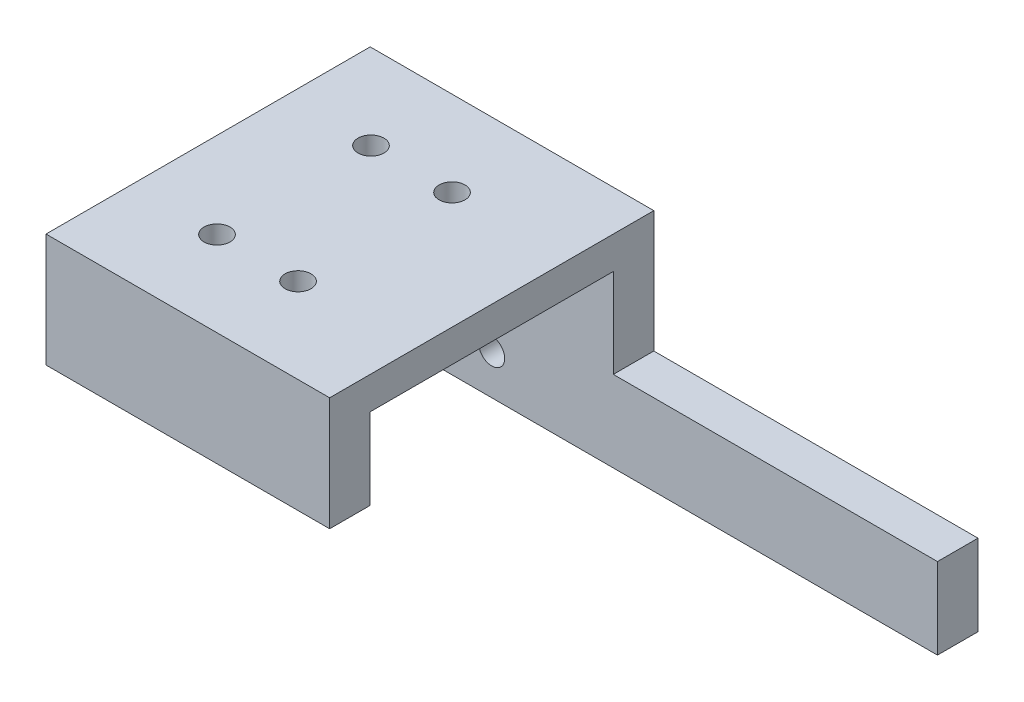
ISO-10303-21;
HEADER;
FILE_DESCRIPTION(('STEP AP214'),'2;1');
FILE_NAME('part.step','',(''),(''),'','','');
FILE_SCHEMA(('AUTOMOTIVE_DESIGN { 1 0 10303 214 1 1 1 1 }'));
ENDSEC;
DATA;
#1=APPLICATION_CONTEXT('core data for automotive mechanical design processes');
#2=APPLICATION_PROTOCOL_DEFINITION('international standard','automotive_design',2000,#1);
#3=PRODUCT_CONTEXT('',#1,'mechanical');
#4=PRODUCT('Part','Part','',(#3));
#5=PRODUCT_RELATED_PRODUCT_CATEGORY('part','',(#4));
#6=PRODUCT_DEFINITION_FORMATION('','',#4);
#7=PRODUCT_DEFINITION_CONTEXT('part definition',#1,'design');
#8=PRODUCT_DEFINITION('design','',#6,#7);
#9=PRODUCT_DEFINITION_SHAPE('','',#8);
#10=(LENGTH_UNIT() NAMED_UNIT(*) SI_UNIT(.MILLI.,.METRE.));
#11=(NAMED_UNIT(*) PLANE_ANGLE_UNIT() SI_UNIT($,.RADIAN.));
#12=(NAMED_UNIT(*) SI_UNIT($,.STERADIAN.) SOLID_ANGLE_UNIT());
#13=UNCERTAINTY_MEASURE_WITH_UNIT(LENGTH_MEASURE(1.E-05),#10,'distance_accuracy_value','');
#14=(GEOMETRIC_REPRESENTATION_CONTEXT(3) GLOBAL_UNCERTAINTY_ASSIGNED_CONTEXT((#13)) GLOBAL_UNIT_ASSIGNED_CONTEXT((#10,
#11,#12)) REPRESENTATION_CONTEXT('',''));
#15=CARTESIAN_POINT('',(0.,0.,0.));
#16=DIRECTION('',(0.,0.,1.));
#17=DIRECTION('',(1.,0.,0.));
#18=AXIS2_PLACEMENT_3D('',#15,#16,#17);
#19=CARTESIAN_POINT('',(0.,0.,0.));
#20=DIRECTION('',(0.,-1.,0.));
#21=DIRECTION('',(0.,0.,-1.));
#22=AXIS2_PLACEMENT_3D('',#19,#20,#21);
#23=PLANE('',#22);
#24=CARTESIAN_POINT('',(10.6,0.,-10.5));
#25=DIRECTION('',(0.,-1.,0.));
#26=DIRECTION('',(0.,0.,-1.));
#27=AXIS2_PLACEMENT_3D('',#24,#25,#26);
#28=CIRCLE('',#27,1.6);
#29=CARTESIAN_POINT('',(10.6,0.,-12.1));
#30=VERTEX_POINT('',#29);
#31=EDGE_CURVE('E212',#30,#30,#28,.T.);
#32=ORIENTED_EDGE('',*,*,#31,.F.);
#33=EDGE_LOOP('',(#32));
#34=FACE_BOUND('',#33,.T.);
#35=CARTESIAN_POINT('',(20.6,0.,-10.5));
#36=DIRECTION('',(0.,-1.,0.));
#37=DIRECTION('',(0.,0.,-1.));
#38=AXIS2_PLACEMENT_3D('',#35,#36,#37);
#39=CIRCLE('',#38,1.6);
#40=CARTESIAN_POINT('',(20.6,0.,-12.1));
#41=VERTEX_POINT('',#40);
#42=EDGE_CURVE('E224',#41,#41,#39,.T.);
#43=ORIENTED_EDGE('',*,*,#42,.F.);
#44=EDGE_LOOP('',(#43));
#45=FACE_BOUND('',#44,.T.);
#46=CARTESIAN_POINT('',(20.6,0.,-29.5));
#47=DIRECTION('',(0.,-1.,0.));
#48=DIRECTION('',(0.,0.,-1.));
#49=AXIS2_PLACEMENT_3D('',#46,#47,#48);
#50=CIRCLE('',#49,1.6);
#51=CARTESIAN_POINT('',(20.6,0.,-31.1));
#52=VERTEX_POINT('',#51);
#53=EDGE_CURVE('E221',#52,#52,#50,.T.);
#54=ORIENTED_EDGE('',*,*,#53,.F.);
#55=EDGE_LOOP('',(#54));
#56=FACE_BOUND('',#55,.T.);
#57=CARTESIAN_POINT('',(10.6,0.,-29.5));
#58=DIRECTION('',(0.,-1.,0.));
#59=DIRECTION('',(0.,0.,-1.));
#60=AXIS2_PLACEMENT_3D('',#57,#58,#59);
#61=CIRCLE('',#60,1.6);
#62=CARTESIAN_POINT('',(10.6,0.,-31.1));
#63=VERTEX_POINT('',#62);
#64=EDGE_CURVE('E200',#63,#63,#61,.T.);
#65=ORIENTED_EDGE('',*,*,#64,.F.);
#66=EDGE_LOOP('',(#65));
#67=FACE_BOUND('',#66,.T.);
#68=DIRECTION('',(0.,0.,-1.));
#69=VECTOR('',#68,1.);
#70=CARTESIAN_POINT('',(35.,0.,0.));
#71=LINE('',#70,#69);
#72=CARTESIAN_POINT('',(35.,0.,-5.));
#73=VERTEX_POINT('',#72);
#74=CARTESIAN_POINT('',(35.,0.,-35.));
#75=VERTEX_POINT('',#74);
#76=EDGE_CURVE('E60',#73,#75,#71,.T.);
#77=ORIENTED_EDGE('',*,*,#76,.F.);
#78=DIRECTION('',(1.,0.,0.));
#79=VECTOR('',#78,1.);
#80=CARTESIAN_POINT('',(0.,0.,-5.));
#81=LINE('',#80,#79);
#82=CARTESIAN_POINT('',(0.,0.,-5.));
#83=VERTEX_POINT('',#82);
#84=EDGE_CURVE('E134',#83,#73,#81,.T.);
#85=ORIENTED_EDGE('',*,*,#84,.F.);
#86=DIRECTION('',(0.,0.,1.));
#87=VECTOR('',#86,1.);
#88=CARTESIAN_POINT('',(0.,0.,0.));
#89=LINE('',#88,#87);
#90=CARTESIAN_POINT('',(0.,0.,-35.));
#91=VERTEX_POINT('',#90);
#92=EDGE_CURVE('E138',#91,#83,#89,.T.);
#93=ORIENTED_EDGE('',*,*,#92,.F.);
#94=DIRECTION('',(-1.,0.,0.));
#95=VECTOR('',#94,1.);
#96=CARTESIAN_POINT('',(0.,0.,-35.));
#97=LINE('',#96,#95);
#98=EDGE_CURVE('E177',#75,#91,#97,.T.);
#99=ORIENTED_EDGE('',*,*,#98,.F.);
#100=EDGE_LOOP('',(#77,#85,#93,#99));
#101=FACE_BOUND('',#100,.T.);
#102=ADVANCED_FACE('F35',(#34,#45,#56,#67,#101),#23,.T.);
#103=CARTESIAN_POINT('',(20.,-16.,-25.));
#104=DIRECTION('',(0.,0.,-1.));
#105=DIRECTION('',(-1.,0.,0.));
#106=AXIS2_PLACEMENT_3D('',#103,#104,#105);
#107=CYLINDRICAL_SURFACE('',#106,1.6);
#108=CARTESIAN_POINT('',(20.,-16.,-35.));
#109=DIRECTION('',(0.,0.,-1.));
#110=DIRECTION('',(-1.,0.,0.));
#111=AXIS2_PLACEMENT_3D('',#108,#109,#110);
#112=CIRCLE('',#111,1.6);
#113=CARTESIAN_POINT('',(18.4,-16.,-35.));
#114=VERTEX_POINT('',#113);
#115=EDGE_CURVE('E229',#114,#114,#112,.T.);
#116=ORIENTED_EDGE('',*,*,#115,.F.);
#117=EDGE_LOOP('',(#116));
#118=FACE_BOUND('',#117,.T.);
#119=CARTESIAN_POINT('',(20.,-16.,-38.));
#120=DIRECTION('',(0.,0.,-1.));
#121=DIRECTION('',(-1.,0.,0.));
#122=AXIS2_PLACEMENT_3D('',#119,#120,#121);
#123=CIRCLE('',#122,1.6);
#124=CARTESIAN_POINT('',(18.4,-16.,-38.));
#125=VERTEX_POINT('',#124);
#126=EDGE_CURVE('E39',#125,#125,#123,.F.);
#127=ORIENTED_EDGE('',*,*,#126,.F.);
#128=EDGE_LOOP('',(#127));
#129=FACE_BOUND('',#128,.T.);
#130=ADVANCED_FACE('F241',(#118,#129),#107,.F.);
#131=CARTESIAN_POINT('',(10.,-16.,-25.));
#132=DIRECTION('',(0.,0.,-1.));
#133=DIRECTION('',(-1.,0.,0.));
#134=AXIS2_PLACEMENT_3D('',#131,#132,#133);
#135=CYLINDRICAL_SURFACE('',#134,1.6);
#136=CARTESIAN_POINT('',(10.,-16.,-35.));
#137=DIRECTION('',(0.,0.,-1.));
#138=DIRECTION('',(-1.,0.,0.));
#139=AXIS2_PLACEMENT_3D('',#136,#137,#138);
#140=CIRCLE('',#139,1.6);
#141=CARTESIAN_POINT('',(8.4,-16.,-35.));
#142=VERTEX_POINT('',#141);
#143=EDGE_CURVE('E184',#142,#142,#140,.T.);
#144=ORIENTED_EDGE('',*,*,#143,.F.);
#145=EDGE_LOOP('',(#144));
#146=FACE_BOUND('',#145,.T.);
#147=CARTESIAN_POINT('',(10.,-16.,-38.));
#148=DIRECTION('',(0.,0.,-1.));
#149=DIRECTION('',(-1.,0.,0.));
#150=AXIS2_PLACEMENT_3D('',#147,#148,#149);
#151=CIRCLE('',#150,1.6);
#152=CARTESIAN_POINT('',(8.4,-16.,-38.));
#153=VERTEX_POINT('',#152);
#154=EDGE_CURVE('E164',#153,#153,#151,.F.);
#155=ORIENTED_EDGE('',*,*,#154,.F.);
#156=EDGE_LOOP('',(#155));
#157=FACE_BOUND('',#156,.T.);
#158=ADVANCED_FACE('F243',(#146,#157),#135,.F.);
#159=CARTESIAN_POINT('',(0.,4.,0.));
#160=DIRECTION('',(1.,0.,0.));
#161=DIRECTION('',(0.,0.,-1.));
#162=AXIS2_PLACEMENT_3D('',#159,#160,#161);
#163=PLANE('',#162);
#164=DIRECTION('',(0.,-1.,0.));
#165=VECTOR('',#164,1.);
#166=CARTESIAN_POINT('',(0.,4.,-40.));
#167=LINE('',#166,#165);
#168=CARTESIAN_POINT('',(0.,4.,-40.));
#169=VERTEX_POINT('',#168);
#170=CARTESIAN_POINT('',(0.,-21.,-40.));
#171=VERTEX_POINT('',#170);
#172=EDGE_CURVE('E210',#169,#171,#167,.T.);
#173=ORIENTED_EDGE('',*,*,#172,.T.);
#174=DIRECTION('',(0.,0.,-1.));
#175=VECTOR('',#174,1.);
#176=CARTESIAN_POINT('',(0.,-21.,-40.));
#177=LINE('',#176,#175);
#178=CARTESIAN_POINT('',(0.,-21.,-35.));
#179=VERTEX_POINT('',#178);
#180=EDGE_CURVE('E173',#179,#171,#177,.T.);
#181=ORIENTED_EDGE('',*,*,#180,.F.);
#182=DIRECTION('',(0.,1.,0.));
#183=VECTOR('',#182,1.);
#184=CARTESIAN_POINT('',(0.,-21.,-35.));
#185=LINE('',#184,#183);
#186=EDGE_CURVE('E181',#179,#91,#185,.T.);
#187=ORIENTED_EDGE('',*,*,#186,.T.);
#188=ORIENTED_EDGE('',*,*,#92,.T.);
#189=DIRECTION('',(0.,1.,0.));
#190=VECTOR('',#189,1.);
#191=CARTESIAN_POINT('',(0.,-10.,-5.));
#192=LINE('',#191,#190);
#193=CARTESIAN_POINT('',(0.,-10.,-5.));
#194=VERTEX_POINT('',#193);
#195=EDGE_CURVE('E118',#194,#83,#192,.T.);
#196=ORIENTED_EDGE('',*,*,#195,.F.);
#197=DIRECTION('',(0.,0.,-1.));
#198=VECTOR('',#197,1.);
#199=CARTESIAN_POINT('',(0.,-10.,0.));
#200=LINE('',#199,#198);
#201=CARTESIAN_POINT('',(0.,-10.,0.));
#202=VERTEX_POINT('',#201);
#203=EDGE_CURVE('E125',#202,#194,#200,.T.);
#204=ORIENTED_EDGE('',*,*,#203,.F.);
#205=DIRECTION('',(0.,-1.,0.));
#206=VECTOR('',#205,1.);
#207=CARTESIAN_POINT('',(0.,4.,0.));
#208=LINE('',#207,#206);
#209=CARTESIAN_POINT('',(0.,4.,0.));
#210=VERTEX_POINT('',#209);
#211=EDGE_CURVE('E11',#210,#202,#208,.T.);
#212=ORIENTED_EDGE('',*,*,#211,.F.);
#213=DIRECTION('',(0.,0.,1.));
#214=VECTOR('',#213,1.);
#215=CARTESIAN_POINT('',(0.,4.,0.));
#216=LINE('',#215,#214);
#217=EDGE_CURVE('E201',#169,#210,#216,.T.);
#218=ORIENTED_EDGE('',*,*,#217,.F.);
#219=EDGE_LOOP('',(#173,#181,#187,#188,#196,#204,#212,#218));
#220=FACE_BOUND('',#219,.T.);
#221=ADVANCED_FACE('F37',(#220),#163,.F.);
#222=CARTESIAN_POINT('',(0.,4.,0.));
#223=DIRECTION('',(0.,0.,-1.));
#224=DIRECTION('',(-1.,0.,0.));
#225=AXIS2_PLACEMENT_3D('',#222,#223,#224);
#226=PLANE('',#225);
#227=ORIENTED_EDGE('',*,*,#211,.T.);
#228=DIRECTION('',(-1.,0.,0.));
#229=VECTOR('',#228,1.);
#230=CARTESIAN_POINT('',(0.,-10.,0.));
#231=LINE('',#230,#229);
#232=CARTESIAN_POINT('',(35.,-10.,0.));
#233=VERTEX_POINT('',#232);
#234=EDGE_CURVE('E131',#233,#202,#231,.T.);
#235=ORIENTED_EDGE('',*,*,#234,.F.);
#236=DIRECTION('',(0.,-1.,0.));
#237=VECTOR('',#236,1.);
#238=CARTESIAN_POINT('',(35.,4.,0.));
#239=LINE('',#238,#237);
#240=CARTESIAN_POINT('',(35.,4.,0.));
#241=VERTEX_POINT('',#240);
#242=EDGE_CURVE('E44',#241,#233,#239,.T.);
#243=ORIENTED_EDGE('',*,*,#242,.F.);
#244=DIRECTION('',(1.,0.,0.));
#245=VECTOR('',#244,1.);
#246=CARTESIAN_POINT('',(0.,4.,0.));
#247=LINE('',#246,#245);
#248=EDGE_CURVE('E204',#210,#241,#247,.T.);
#249=ORIENTED_EDGE('',*,*,#248,.F.);
#250=EDGE_LOOP('',(#227,#235,#243,#249));
#251=FACE_BOUND('',#250,.T.);
#252=ADVANCED_FACE('F292',(#251),#226,.F.);
#253=CARTESIAN_POINT('',(35.,4.,0.));
#254=DIRECTION('',(-1.,0.,0.));
#255=DIRECTION('',(0.,0.,1.));
#256=AXIS2_PLACEMENT_3D('',#253,#254,#255);
#257=PLANE('',#256);
#258=DIRECTION('',(0.,1.,0.));
#259=VECTOR('',#258,1.);
#260=CARTESIAN_POINT('',(35.,-21.,-35.));
#261=LINE('',#260,#259);
#262=CARTESIAN_POINT('',(35.,-11.,-35.));
#263=VERTEX_POINT('',#262);
#264=EDGE_CURVE('E186',#263,#75,#261,.T.);
#265=ORIENTED_EDGE('',*,*,#264,.F.);
#266=DIRECTION('',(0.,0.,-1.));
#267=VECTOR('',#266,1.);
#268=CARTESIAN_POINT('',(35.,-11.,-35.));
#269=LINE('',#268,#267);
#270=CARTESIAN_POINT('',(35.,-11.,-40.));
#271=VERTEX_POINT('',#270);
#272=EDGE_CURVE('E150',#263,#271,#269,.T.);
#273=ORIENTED_EDGE('',*,*,#272,.T.);
#274=DIRECTION('',(0.,-1.,0.));
#275=VECTOR('',#274,1.);
#276=CARTESIAN_POINT('',(35.,4.,-40.));
#277=LINE('',#276,#275);
#278=CARTESIAN_POINT('',(35.,4.,-40.));
#279=VERTEX_POINT('',#278);
#280=EDGE_CURVE('E215',#279,#271,#277,.T.);
#281=ORIENTED_EDGE('',*,*,#280,.F.);
#282=DIRECTION('',(0.,0.,-1.));
#283=VECTOR('',#282,1.);
#284=CARTESIAN_POINT('',(35.,4.,0.));
#285=LINE('',#284,#283);
#286=EDGE_CURVE('E206',#241,#279,#285,.T.);
#287=ORIENTED_EDGE('',*,*,#286,.F.);
#288=ORIENTED_EDGE('',*,*,#242,.T.);
#289=DIRECTION('',(0.,0.,1.));
#290=VECTOR('',#289,1.);
#291=CARTESIAN_POINT('',(35.,-10.,0.));
#292=LINE('',#291,#290);
#293=CARTESIAN_POINT('',(35.,-10.,-5.));
#294=VERTEX_POINT('',#293);
#295=EDGE_CURVE('E124',#294,#233,#292,.T.);
#296=ORIENTED_EDGE('',*,*,#295,.F.);
#297=DIRECTION('',(0.,1.,0.));
#298=VECTOR('',#297,1.);
#299=CARTESIAN_POINT('',(35.,-10.,-5.));
#300=LINE('',#299,#298);
#301=EDGE_CURVE('E120',#294,#73,#300,.T.);
#302=ORIENTED_EDGE('',*,*,#301,.T.);
#303=ORIENTED_EDGE('',*,*,#76,.T.);
#304=EDGE_LOOP('',(#265,#273,#281,#287,#288,#296,#302,#303));
#305=FACE_BOUND('',#304,.T.);
#306=ADVANCED_FACE('F289',(#305),#257,.F.);
#307=CARTESIAN_POINT('',(0.,4.,-40.));
#308=DIRECTION('',(0.,0.,1.));
#309=DIRECTION('',(1.,0.,0.));
#310=AXIS2_PLACEMENT_3D('',#307,#308,#309);
#311=PLANE('',#310);
#312=CARTESIAN_POINT('',(20.,-16.,-40.));
#313=DIRECTION('',(0.,0.,-1.));
#314=DIRECTION('',(-1.,0.,0.));
#315=AXIS2_PLACEMENT_3D('',#312,#313,#314);
#316=CIRCLE('',#315,2.8);
#317=CARTESIAN_POINT('',(17.2,-16.,-40.));
#318=VERTEX_POINT('',#317);
#319=EDGE_CURVE('E165',#318,#318,#316,.T.);
#320=ORIENTED_EDGE('',*,*,#319,.F.);
#321=EDGE_LOOP('',(#320));
#322=FACE_BOUND('',#321,.T.);
#323=CARTESIAN_POINT('',(10.,-16.,-40.));
#324=DIRECTION('',(0.,0.,-1.));
#325=DIRECTION('',(-1.,0.,0.));
#326=AXIS2_PLACEMENT_3D('',#323,#324,#325);
#327=CIRCLE('',#326,2.8);
#328=CARTESIAN_POINT('',(7.2,-16.,-40.));
#329=VERTEX_POINT('',#328);
#330=EDGE_CURVE('E157',#329,#329,#327,.T.);
#331=ORIENTED_EDGE('',*,*,#330,.F.);
#332=EDGE_LOOP('',(#331));
#333=FACE_BOUND('',#332,.T.);
#334=ORIENTED_EDGE('',*,*,#280,.T.);
#335=DIRECTION('',(1.,0.,0.));
#336=VECTOR('',#335,1.);
#337=CARTESIAN_POINT('',(35.,-11.,-40.));
#338=LINE('',#337,#336);
#339=CARTESIAN_POINT('',(75.,-11.,-40.));
#340=VERTEX_POINT('',#339);
#341=EDGE_CURVE('E52',#271,#340,#338,.T.);
#342=ORIENTED_EDGE('',*,*,#341,.T.);
#343=DIRECTION('',(0.,-1.,0.));
#344=VECTOR('',#343,1.);
#345=CARTESIAN_POINT('',(75.,-21.,-40.));
#346=LINE('',#345,#344);
#347=CARTESIAN_POINT('',(75.,-21.,-40.));
#348=VERTEX_POINT('',#347);
#349=EDGE_CURVE('E140',#340,#348,#346,.T.);
#350=ORIENTED_EDGE('',*,*,#349,.T.);
#351=DIRECTION('',(1.,0.,0.));
#352=VECTOR('',#351,1.);
#353=CARTESIAN_POINT('',(0.,-21.,-40.));
#354=LINE('',#353,#352);
#355=EDGE_CURVE('E176',#171,#348,#354,.T.);
#356=ORIENTED_EDGE('',*,*,#355,.F.);
#357=ORIENTED_EDGE('',*,*,#172,.F.);
#358=DIRECTION('',(-1.,0.,0.));
#359=VECTOR('',#358,1.);
#360=CARTESIAN_POINT('',(0.,4.,-40.));
#361=LINE('',#360,#359);
#362=EDGE_CURVE('E208',#279,#169,#361,.T.);
#363=ORIENTED_EDGE('',*,*,#362,.F.);
#364=EDGE_LOOP('',(#334,#342,#350,#356,#357,#363));
#365=FACE_BOUND('',#364,.T.);
#366=ADVANCED_FACE('F284',(#322,#333,#365),#311,.F.);
#367=CARTESIAN_POINT('',(0.,4.,0.));
#368=DIRECTION('',(0.,-1.,0.));
#369=DIRECTION('',(0.,0.,-1.));
#370=AXIS2_PLACEMENT_3D('',#367,#368,#369);
#371=PLANE('',#370);
#372=CARTESIAN_POINT('',(10.6,4.,-10.5));
#373=DIRECTION('',(0.,1.,0.));
#374=DIRECTION('',(0.,0.,-1.));
#375=AXIS2_PLACEMENT_3D('',#372,#373,#374);
#376=CIRCLE('',#375,1.6);
#377=CARTESIAN_POINT('',(10.6,4.,-12.1));
#378=VERTEX_POINT('',#377);
#379=EDGE_CURVE('E188',#378,#378,#376,.T.);
#380=ORIENTED_EDGE('',*,*,#379,.F.);
#381=EDGE_LOOP('',(#380));
#382=FACE_BOUND('',#381,.T.);
#383=CARTESIAN_POINT('',(20.6,4.,-10.5));
#384=DIRECTION('',(0.,1.,0.));
#385=DIRECTION('',(0.,0.,1.));
#386=AXIS2_PLACEMENT_3D('',#383,#384,#385);
#387=CIRCLE('',#386,1.6);
#388=CARTESIAN_POINT('',(20.6,4.,-8.9));
#389=VERTEX_POINT('',#388);
#390=EDGE_CURVE('E193',#389,#389,#387,.T.);
#391=ORIENTED_EDGE('',*,*,#390,.F.);
#392=EDGE_LOOP('',(#391));
#393=FACE_BOUND('',#392,.T.);
#394=CARTESIAN_POINT('',(20.6,4.,-29.5));
#395=DIRECTION('',(0.,1.,0.));
#396=DIRECTION('',(0.,0.,-1.));
#397=AXIS2_PLACEMENT_3D('',#394,#395,#396);
#398=CIRCLE('',#397,1.6);
#399=CARTESIAN_POINT('',(20.6,4.,-31.1));
#400=VERTEX_POINT('',#399);
#401=EDGE_CURVE('E189',#400,#400,#398,.T.);
#402=ORIENTED_EDGE('',*,*,#401,.F.);
#403=EDGE_LOOP('',(#402));
#404=FACE_BOUND('',#403,.T.);
#405=CARTESIAN_POINT('',(10.6,4.,-29.5));
#406=DIRECTION('',(0.,1.,0.));
#407=DIRECTION('',(0.,0.,1.));
#408=AXIS2_PLACEMENT_3D('',#405,#406,#407);
#409=CIRCLE('',#408,1.6);
#410=CARTESIAN_POINT('',(10.6,4.,-27.9));
#411=VERTEX_POINT('',#410);
#412=EDGE_CURVE('E192',#411,#411,#409,.T.);
#413=ORIENTED_EDGE('',*,*,#412,.F.);
#414=EDGE_LOOP('',(#413));
#415=FACE_BOUND('',#414,.T.);
#416=ORIENTED_EDGE('',*,*,#217,.T.);
#417=ORIENTED_EDGE('',*,*,#248,.T.);
#418=ORIENTED_EDGE('',*,*,#286,.T.);
#419=ORIENTED_EDGE('',*,*,#362,.T.);
#420=EDGE_LOOP('',(#416,#417,#418,#419));
#421=FACE_BOUND('',#420,.T.);
#422=ADVANCED_FACE('F281',(#382,#393,#404,#415,#421),#371,.F.);
#423=CARTESIAN_POINT('',(10.6,-2.,-29.5));
#424=DIRECTION('',(0.,1.,0.));
#425=DIRECTION('',(0.,0.,1.));
#426=AXIS2_PLACEMENT_3D('',#423,#424,#425);
#427=CYLINDRICAL_SURFACE('',#426,1.6);
#428=ORIENTED_EDGE('',*,*,#64,.T.);
#429=EDGE_LOOP('',(#428));
#430=FACE_BOUND('',#429,.T.);
#431=ORIENTED_EDGE('',*,*,#412,.T.);
#432=EDGE_LOOP('',(#431));
#433=FACE_BOUND('',#432,.T.);
#434=ADVANCED_FACE('F271',(#430,#433),#427,.F.);
#435=CARTESIAN_POINT('',(20.6,-2.,-29.5));
#436=DIRECTION('',(0.,1.,0.));
#437=DIRECTION('',(0.,0.,1.));
#438=AXIS2_PLACEMENT_3D('',#435,#436,#437);
#439=CYLINDRICAL_SURFACE('',#438,1.6);
#440=ORIENTED_EDGE('',*,*,#53,.T.);
#441=EDGE_LOOP('',(#440));
#442=FACE_BOUND('',#441,.T.);
#443=ORIENTED_EDGE('',*,*,#401,.T.);
#444=EDGE_LOOP('',(#443));
#445=FACE_BOUND('',#444,.T.);
#446=ADVANCED_FACE('F267',(#442,#445),#439,.F.);
#447=CARTESIAN_POINT('',(20.6,-2.,-10.5));
#448=DIRECTION('',(0.,1.,0.));
#449=DIRECTION('',(0.,0.,1.));
#450=AXIS2_PLACEMENT_3D('',#447,#448,#449);
#451=CYLINDRICAL_SURFACE('',#450,1.6);
#452=ORIENTED_EDGE('',*,*,#42,.T.);
#453=EDGE_LOOP('',(#452));
#454=FACE_BOUND('',#453,.T.);
#455=ORIENTED_EDGE('',*,*,#390,.T.);
#456=EDGE_LOOP('',(#455));
#457=FACE_BOUND('',#456,.T.);
#458=ADVANCED_FACE('F270',(#454,#457),#451,.F.);
#459=CARTESIAN_POINT('',(10.6,-2.,-10.5));
#460=DIRECTION('',(0.,1.,0.));
#461=DIRECTION('',(0.,0.,1.));
#462=AXIS2_PLACEMENT_3D('',#459,#460,#461);
#463=CYLINDRICAL_SURFACE('',#462,1.6);
#464=ORIENTED_EDGE('',*,*,#31,.T.);
#465=EDGE_LOOP('',(#464));
#466=FACE_BOUND('',#465,.T.);
#467=ORIENTED_EDGE('',*,*,#379,.T.);
#468=EDGE_LOOP('',(#467));
#469=FACE_BOUND('',#468,.T.);
#470=ADVANCED_FACE('F265',(#466,#469),#463,.F.);
#471=CARTESIAN_POINT('',(0.,-21.,-35.));
#472=DIRECTION('',(0.,0.,-1.));
#473=DIRECTION('',(-1.,0.,0.));
#474=AXIS2_PLACEMENT_3D('',#471,#472,#473);
#475=PLANE('',#474);
#476=ORIENTED_EDGE('',*,*,#143,.T.);
#477=EDGE_LOOP('',(#476));
#478=FACE_BOUND('',#477,.T.);
#479=ORIENTED_EDGE('',*,*,#115,.T.);
#480=EDGE_LOOP('',(#479));
#481=FACE_BOUND('',#480,.T.);
#482=ORIENTED_EDGE('',*,*,#98,.T.);
#483=ORIENTED_EDGE('',*,*,#186,.F.);
#484=DIRECTION('',(-1.,0.,0.));
#485=VECTOR('',#484,1.);
#486=CARTESIAN_POINT('',(0.,-21.,-35.));
#487=LINE('',#486,#485);
#488=CARTESIAN_POINT('',(75.,-21.,-35.));
#489=VERTEX_POINT('',#488);
#490=EDGE_CURVE('E179',#489,#179,#487,.T.);
#491=ORIENTED_EDGE('',*,*,#490,.F.);
#492=DIRECTION('',(0.,-1.,0.));
#493=VECTOR('',#492,1.);
#494=CARTESIAN_POINT('',(75.,-21.,-35.));
#495=LINE('',#494,#493);
#496=CARTESIAN_POINT('',(75.,-11.,-35.));
#497=VERTEX_POINT('',#496);
#498=EDGE_CURVE('E148',#497,#489,#495,.T.);
#499=ORIENTED_EDGE('',*,*,#498,.F.);
#500=DIRECTION('',(1.,0.,0.));
#501=VECTOR('',#500,1.);
#502=CARTESIAN_POINT('',(35.,-11.,-35.));
#503=LINE('',#502,#501);
#504=EDGE_CURVE('E145',#263,#497,#503,.T.);
#505=ORIENTED_EDGE('',*,*,#504,.F.);
#506=ORIENTED_EDGE('',*,*,#264,.T.);
#507=EDGE_LOOP('',(#482,#483,#491,#499,#505,#506));
#508=FACE_BOUND('',#507,.T.);
#509=ADVANCED_FACE('F261',(#478,#481,#508),#475,.F.);
#510=CARTESIAN_POINT('',(0.,-21.,0.));
#511=DIRECTION('',(0.,1.,0.));
#512=DIRECTION('',(0.,0.,1.));
#513=AXIS2_PLACEMENT_3D('',#510,#511,#512);
#514=PLANE('',#513);
#515=ORIENTED_EDGE('',*,*,#180,.T.);
#516=ORIENTED_EDGE('',*,*,#355,.T.);
#517=DIRECTION('',(0.,0.,-1.));
#518=VECTOR('',#517,1.);
#519=CARTESIAN_POINT('',(75.,-21.,-35.));
#520=LINE('',#519,#518);
#521=EDGE_CURVE('E154',#489,#348,#520,.T.);
#522=ORIENTED_EDGE('',*,*,#521,.F.);
#523=ORIENTED_EDGE('',*,*,#490,.T.);
#524=EDGE_LOOP('',(#515,#516,#522,#523));
#525=FACE_BOUND('',#524,.T.);
#526=ADVANCED_FACE('F257',(#525),#514,.F.);
#527=CARTESIAN_POINT('',(10.,-16.,-38.));
#528=DIRECTION('',(0.,0.,-1.));
#529=DIRECTION('',(-1.,0.,0.));
#530=AXIS2_PLACEMENT_3D('',#527,#528,#529);
#531=PLANE('',#530);
#532=CARTESIAN_POINT('',(10.,-16.,-38.));
#533=DIRECTION('',(0.,0.,-1.));
#534=DIRECTION('',(-1.,0.,0.));
#535=AXIS2_PLACEMENT_3D('',#532,#533,#534);
#536=CIRCLE('',#535,2.8);
#537=CARTESIAN_POINT('',(7.2,-16.,-38.));
#538=VERTEX_POINT('',#537);
#539=EDGE_CURVE('E168',#538,#538,#536,.T.);
#540=ORIENTED_EDGE('',*,*,#539,.T.);
#541=EDGE_LOOP('',(#540));
#542=FACE_BOUND('',#541,.T.);
#543=ORIENTED_EDGE('',*,*,#154,.T.);
#544=EDGE_LOOP('',(#543));
#545=FACE_BOUND('',#544,.T.);
#546=ADVANCED_FACE('F260',(#542,#545),#531,.T.);
#547=CARTESIAN_POINT('',(10.,-16.,-38.));
#548=DIRECTION('',(0.,0.,-1.));
#549=DIRECTION('',(-1.,0.,0.));
#550=AXIS2_PLACEMENT_3D('',#547,#548,#549);
#551=CYLINDRICAL_SURFACE('',#550,2.8);
#552=ORIENTED_EDGE('',*,*,#539,.F.);
#553=EDGE_LOOP('',(#552));
#554=FACE_BOUND('',#553,.T.);
#555=ORIENTED_EDGE('',*,*,#330,.T.);
#556=EDGE_LOOP('',(#555));
#557=FACE_BOUND('',#556,.T.);
#558=ADVANCED_FACE('F335',(#554,#557),#551,.F.);
#559=CARTESIAN_POINT('',(20.,-16.,-38.));
#560=DIRECTION('',(0.,0.,-1.));
#561=DIRECTION('',(-1.,0.,0.));
#562=AXIS2_PLACEMENT_3D('',#559,#560,#561);
#563=PLANE('',#562);
#564=CARTESIAN_POINT('',(20.,-16.,-38.));
#565=DIRECTION('',(0.,0.,-1.));
#566=DIRECTION('',(-1.,0.,0.));
#567=AXIS2_PLACEMENT_3D('',#564,#565,#566);
#568=CIRCLE('',#567,2.8);
#569=CARTESIAN_POINT('',(17.2,-16.,-38.));
#570=VERTEX_POINT('',#569);
#571=EDGE_CURVE('E161',#570,#570,#568,.T.);
#572=ORIENTED_EDGE('',*,*,#571,.T.);
#573=EDGE_LOOP('',(#572));
#574=FACE_BOUND('',#573,.T.);
#575=ORIENTED_EDGE('',*,*,#126,.T.);
#576=EDGE_LOOP('',(#575));
#577=FACE_BOUND('',#576,.T.);
#578=ADVANCED_FACE('F239',(#574,#577),#563,.T.);
#579=CARTESIAN_POINT('',(20.,-16.,-38.));
#580=DIRECTION('',(0.,0.,-1.));
#581=DIRECTION('',(-1.,0.,0.));
#582=AXIS2_PLACEMENT_3D('',#579,#580,#581);
#583=CYLINDRICAL_SURFACE('',#582,2.8);
#584=ORIENTED_EDGE('',*,*,#571,.F.);
#585=EDGE_LOOP('',(#584));
#586=FACE_BOUND('',#585,.T.);
#587=ORIENTED_EDGE('',*,*,#319,.T.);
#588=EDGE_LOOP('',(#587));
#589=FACE_BOUND('',#588,.T.);
#590=ADVANCED_FACE('F322',(#586,#589),#583,.F.);
#591=CARTESIAN_POINT('',(75.,-21.,-35.));
#592=DIRECTION('',(1.,0.,0.));
#593=DIRECTION('',(0.,0.,-1.));
#594=AXIS2_PLACEMENT_3D('',#591,#592,#593);
#595=PLANE('',#594);
#596=ORIENTED_EDGE('',*,*,#349,.F.);
#597=DIRECTION('',(0.,0.,-1.));
#598=VECTOR('',#597,1.);
#599=CARTESIAN_POINT('',(75.,-11.,-35.));
#600=LINE('',#599,#598);
#601=EDGE_CURVE('E158',#497,#340,#600,.T.);
#602=ORIENTED_EDGE('',*,*,#601,.F.);
#603=ORIENTED_EDGE('',*,*,#498,.T.);
#604=ORIENTED_EDGE('',*,*,#521,.T.);
#605=EDGE_LOOP('',(#596,#602,#603,#604));
#606=FACE_BOUND('',#605,.T.);
#607=ADVANCED_FACE('F320',(#606),#595,.T.);
#608=CARTESIAN_POINT('',(35.,-11.,-35.));
#609=DIRECTION('',(0.,1.,0.));
#610=DIRECTION('',(-1.,0.,0.));
#611=AXIS2_PLACEMENT_3D('',#608,#609,#610);
#612=PLANE('',#611);
#613=ORIENTED_EDGE('',*,*,#341,.F.);
#614=ORIENTED_EDGE('',*,*,#272,.F.);
#615=ORIENTED_EDGE('',*,*,#504,.T.);
#616=ORIENTED_EDGE('',*,*,#601,.T.);
#617=EDGE_LOOP('',(#613,#614,#615,#616));
#618=FACE_BOUND('',#617,.T.);
#619=ADVANCED_FACE('F318',(#618),#612,.T.);
#620=CARTESIAN_POINT('',(0.,-10.,-5.));
#621=DIRECTION('',(0.,0.,1.));
#622=DIRECTION('',(1.,0.,0.));
#623=AXIS2_PLACEMENT_3D('',#620,#621,#622);
#624=PLANE('',#623);
#625=ORIENTED_EDGE('',*,*,#84,.T.);
#626=ORIENTED_EDGE('',*,*,#301,.F.);
#627=DIRECTION('',(1.,0.,0.));
#628=VECTOR('',#627,1.);
#629=CARTESIAN_POINT('',(0.,-10.,-5.));
#630=LINE('',#629,#628);
#631=EDGE_CURVE('E114',#194,#294,#630,.T.);
#632=ORIENTED_EDGE('',*,*,#631,.F.);
#633=ORIENTED_EDGE('',*,*,#195,.T.);
#634=EDGE_LOOP('',(#625,#626,#632,#633));
#635=FACE_BOUND('',#634,.T.);
#636=ADVANCED_FACE('F116',(#635),#624,.F.);
#637=CARTESIAN_POINT('',(0.,-10.,0.));
#638=DIRECTION('',(0.,-1.,0.));
#639=DIRECTION('',(0.,0.,-1.));
#640=AXIS2_PLACEMENT_3D('',#637,#638,#639);
#641=PLANE('',#640);
#642=ORIENTED_EDGE('',*,*,#203,.T.);
#643=ORIENTED_EDGE('',*,*,#631,.T.);
#644=ORIENTED_EDGE('',*,*,#295,.T.);
#645=ORIENTED_EDGE('',*,*,#234,.T.);
#646=EDGE_LOOP('',(#642,#643,#644,#645));
#647=FACE_BOUND('',#646,.T.);
#648=ADVANCED_FACE('F129',(#647),#641,.T.);
#649=CLOSED_SHELL('',(#102,#130,#158,#221,#252,#306,#366,#422,#434,#446,#458,#470,#509,#526,
#546,#558,#578,#590,#607,#619,#636,#648));
#650=MANIFOLD_SOLID_BREP('B2',#649);
#651=ADVANCED_BREP_SHAPE_REPRESENTATION('',(#18,#650),#14);
#652=SHAPE_DEFINITION_REPRESENTATION(#9,#651);
ENDSEC;
END-ISO-10303-21;
